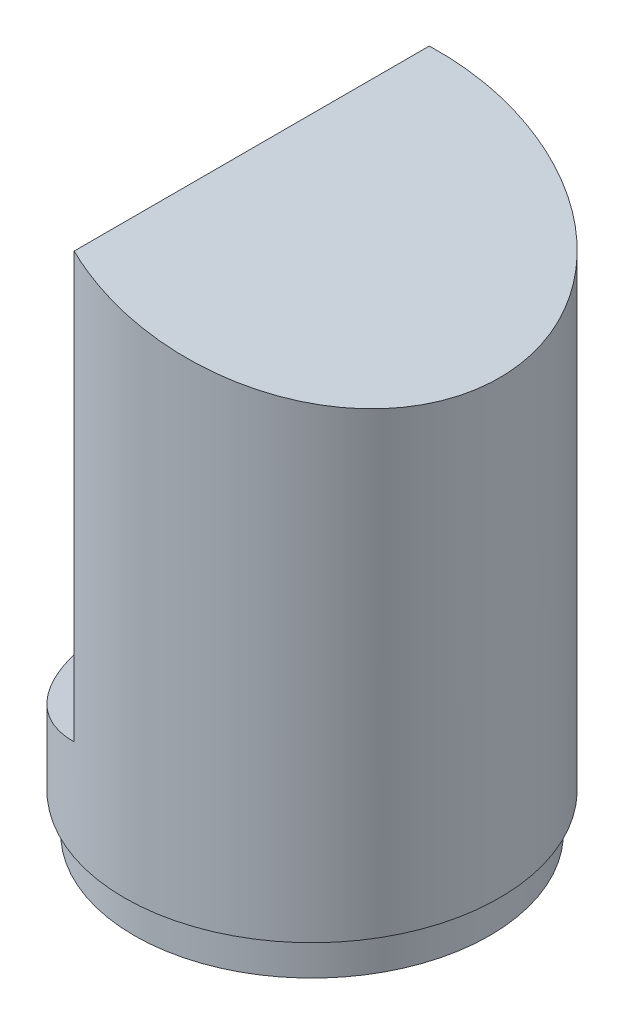
ISO-10303-21;
HEADER;
FILE_DESCRIPTION(('STEP AP214'),'2;1');
FILE_NAME('part.step','',(''),(''),'','','');
FILE_SCHEMA(('AUTOMOTIVE_DESIGN { 1 0 10303 214 1 1 1 1 }'));
ENDSEC;
DATA;
#1=APPLICATION_CONTEXT('core data for automotive mechanical design processes');
#2=APPLICATION_PROTOCOL_DEFINITION('international standard','automotive_design',2000,#1);
#3=PRODUCT_CONTEXT('',#1,'mechanical');
#4=PRODUCT('Part','Part','',(#3));
#5=PRODUCT_RELATED_PRODUCT_CATEGORY('part','',(#4));
#6=PRODUCT_DEFINITION_FORMATION('','',#4);
#7=PRODUCT_DEFINITION_CONTEXT('part definition',#1,'design');
#8=PRODUCT_DEFINITION('design','',#6,#7);
#9=PRODUCT_DEFINITION_SHAPE('','',#8);
#10=(LENGTH_UNIT() NAMED_UNIT(*) SI_UNIT(.MILLI.,.METRE.));
#11=(NAMED_UNIT(*) PLANE_ANGLE_UNIT() SI_UNIT($,.RADIAN.));
#12=(NAMED_UNIT(*) SI_UNIT($,.STERADIAN.) SOLID_ANGLE_UNIT());
#13=UNCERTAINTY_MEASURE_WITH_UNIT(LENGTH_MEASURE(1.E-05),#10,'distance_accuracy_value','');
#14=(GEOMETRIC_REPRESENTATION_CONTEXT(3) GLOBAL_UNCERTAINTY_ASSIGNED_CONTEXT((#13)) GLOBAL_UNIT_ASSIGNED_CONTEXT((#10,
#11,#12)) REPRESENTATION_CONTEXT('',''));
#15=CARTESIAN_POINT('',(0.,0.,0.));
#16=DIRECTION('',(0.,0.,1.));
#17=DIRECTION('',(1.,0.,0.));
#18=AXIS2_PLACEMENT_3D('',#15,#16,#17);
#19=CARTESIAN_POINT('',(0.,45.,0.));
#20=DIRECTION('',(0.,-1.,0.));
#21=DIRECTION('',(0.,0.,-1.));
#22=AXIS2_PLACEMENT_3D('',#19,#20,#21);
#23=CYLINDRICAL_SURFACE('',#22,15.);
#24=CARTESIAN_POINT('',(0.,3.,0.));
#25=DIRECTION('',(0.,-1.,0.));
#26=DIRECTION('',(0.,0.,-1.));
#27=AXIS2_PLACEMENT_3D('',#24,#25,#26);
#28=CIRCLE('',#27,15.);
#29=CARTESIAN_POINT('',(0.,3.,-15.));
#30=VERTEX_POINT('',#29);
#31=EDGE_CURVE('E149',#30,#30,#28,.T.);
#32=ORIENTED_EDGE('',*,*,#31,.F.);
#33=EDGE_LOOP('',(#32));
#34=FACE_BOUND('',#33,.T.);
#35=DIRECTION('',(0.,1.,0.));
#36=VECTOR('',#35,1.);
#37=CARTESIAN_POINT('',(-4.82199399753466,11.,-14.2038154693638));
#38=LINE('',#37,#36);
#39=CARTESIAN_POINT('',(-4.82199399753466,11.,-14.2038154693638));
#40=VERTEX_POINT('',#39);
#41=CARTESIAN_POINT('',(-4.82199399753466,45.,-14.2038154693639));
#42=VERTEX_POINT('',#41);
#43=EDGE_CURVE('E68',#40,#42,#38,.T.);
#44=ORIENTED_EDGE('',*,*,#43,.T.);
#45=CARTESIAN_POINT('',(0.,43.5465537176237,0.));
#46=DIRECTION('',(-0.288595118782341,-0.957451229784059,0.));
#47=DIRECTION('',(0.957451229784059,-0.288595118782341,0.));
#48=AXIS2_PLACEMENT_3D('',#45,#46,#47);
#49=ELLIPSE('',#48,15.6665943218675,15.);
#50=CARTESIAN_POINT('',(-4.82199399753466,45.,14.2038154693638));
#51=VERTEX_POINT('',#50);
#52=EDGE_CURVE('E126',#51,#42,#49,.F.);
#53=ORIENTED_EDGE('',*,*,#52,.F.);
#54=DIRECTION('',(0.,1.,0.));
#55=VECTOR('',#54,1.);
#56=CARTESIAN_POINT('',(-4.82199399753466,11.,14.2038154693638));
#57=LINE('',#56,#55);
#58=CARTESIAN_POINT('',(-4.82199399753466,11.,14.2038154693638));
#59=VERTEX_POINT('',#58);
#60=EDGE_CURVE('E13',#59,#51,#57,.T.);
#61=ORIENTED_EDGE('',*,*,#60,.F.);
#62=CARTESIAN_POINT('',(0.,12.7075495888941,0.));
#63=DIRECTION('',(-0.333805462248969,0.942641985789277,0.));
#64=DIRECTION('',(-0.942641985789277,-0.333805462248969,0.));
#65=AXIS2_PLACEMENT_3D('',#62,#63,#64);
#66=ELLIPSE('',#65,15.9127221427979,15.);
#67=EDGE_CURVE('E153',#59,#40,#66,.F.);
#68=ORIENTED_EDGE('',*,*,#67,.T.);
#69=EDGE_LOOP('',(#44,#53,#61,#68));
#70=FACE_BOUND('',#69,.T.);
#71=ADVANCED_FACE('F59',(#34,#70),#23,.T.);
#72=CARTESIAN_POINT('',(-4.82199399753466,11.,0.));
#73=DIRECTION('',(-1.,0.,0.));
#74=DIRECTION('',(0.,0.,1.));
#75=AXIS2_PLACEMENT_3D('',#72,#73,#74);
#76=PLANE('',#75);
#77=CARTESIAN_POINT('',(-4.82199399753466,25.8483756418222,0.));
#78=DIRECTION('',(-1.,0.,0.));
#79=DIRECTION('',(0.,0.,1.));
#80=AXIS2_PLACEMENT_3D('',#77,#78,#79);
#81=CIRCLE('',#80,4.5159298216396);
#82=CARTESIAN_POINT('',(-4.82199399753466,25.8483756418222,4.5159298216396));
#83=VERTEX_POINT('',#82);
#84=EDGE_CURVE('E356',#83,#83,#81,.T.);
#85=ORIENTED_EDGE('',*,*,#84,.F.);
#86=EDGE_LOOP('',(#85));
#87=FACE_BOUND('',#86,.T.);
#88=DIRECTION('',(0.,0.,1.));
#89=VECTOR('',#88,1.);
#90=CARTESIAN_POINT('',(-4.82199399753466,45.,0.));
#91=LINE('',#90,#89);
#92=EDGE_CURVE('E156',#42,#51,#91,.T.);
#93=ORIENTED_EDGE('',*,*,#92,.F.);
#94=ORIENTED_EDGE('',*,*,#43,.F.);
#95=DIRECTION('',(0.,0.,1.));
#96=VECTOR('',#95,1.);
#97=CARTESIAN_POINT('',(-4.82199399753466,11.,0.));
#98=LINE('',#97,#96);
#99=EDGE_CURVE('E75',#40,#59,#98,.T.);
#100=ORIENTED_EDGE('',*,*,#99,.T.);
#101=ORIENTED_EDGE('',*,*,#60,.T.);
#102=EDGE_LOOP('',(#93,#94,#100,#101));
#103=FACE_BOUND('',#102,.T.);
#104=ADVANCED_FACE('F174',(#87,#103),#76,.T.);
#105=CARTESIAN_POINT('',(-4.82199399753466,11.,-15.2569816537137));
#106=DIRECTION('',(-0.333805462248969,0.942641985789277,0.));
#107=DIRECTION('',(-0.942641985789277,-0.333805462248969,0.));
#108=AXIS2_PLACEMENT_3D('',#105,#106,#107);
#109=PLANE('',#108);
#110=ORIENTED_EDGE('',*,*,#67,.F.);
#111=ORIENTED_EDGE('',*,*,#99,.F.);
#112=EDGE_LOOP('',(#110,#111));
#113=FACE_BOUND('',#112,.T.);
#114=ADVANCED_FACE('F176',(#113),#109,.T.);
#115=CARTESIAN_POINT('',(0.,3.,0.));
#116=DIRECTION('',(0.,-1.,0.));
#117=DIRECTION('',(0.,0.,-1.));
#118=AXIS2_PLACEMENT_3D('',#115,#116,#117);
#119=PLANE('',#118);
#120=CARTESIAN_POINT('',(0.,3.,0.));
#121=DIRECTION('',(0.,-1.,0.));
#122=DIRECTION('',(0.,0.,-1.));
#123=AXIS2_PLACEMENT_3D('',#120,#121,#122);
#124=CIRCLE('',#123,14.2220153833762);
#125=CARTESIAN_POINT('',(0.,3.,-14.2220153833762));
#126=VERTEX_POINT('',#125);
#127=EDGE_CURVE('E145',#126,#126,#124,.T.);
#128=ORIENTED_EDGE('',*,*,#127,.F.);
#129=EDGE_LOOP('',(#128));
#130=FACE_BOUND('',#129,.T.);
#131=ORIENTED_EDGE('',*,*,#31,.T.);
#132=EDGE_LOOP('',(#131));
#133=FACE_BOUND('',#132,.T.);
#134=ADVANCED_FACE('F183',(#130,#133),#119,.T.);
#135=CARTESIAN_POINT('',(0.,3.,0.));
#136=DIRECTION('',(0.,-1.,0.));
#137=DIRECTION('',(0.,0.,-1.));
#138=AXIS2_PLACEMENT_3D('',#135,#136,#137);
#139=CYLINDRICAL_SURFACE('',#138,14.2220153833762);
#140=ORIENTED_EDGE('',*,*,#127,.T.);
#141=EDGE_LOOP('',(#140));
#142=FACE_BOUND('',#141,.T.);
#143=CARTESIAN_POINT('',(0.,0.,0.));
#144=DIRECTION('',(0.,-1.,0.));
#145=DIRECTION('',(0.,0.,-1.));
#146=AXIS2_PLACEMENT_3D('',#143,#144,#145);
#147=CIRCLE('',#146,14.2220153833762);
#148=CARTESIAN_POINT('',(0.,0.,-14.2220153833762));
#149=VERTEX_POINT('',#148);
#150=EDGE_CURVE('E144',#149,#149,#147,.T.);
#151=ORIENTED_EDGE('',*,*,#150,.F.);
#152=EDGE_LOOP('',(#151));
#153=FACE_BOUND('',#152,.T.);
#154=ADVANCED_FACE('F190',(#142,#153),#139,.T.);
#155=CARTESIAN_POINT('',(0.,0.,0.));
#156=DIRECTION('',(0.,1.,0.));
#157=DIRECTION('',(0.,0.,1.));
#158=AXIS2_PLACEMENT_3D('',#155,#156,#157);
#159=PLANE('',#158);
#160=CARTESIAN_POINT('',(0.,0.,0.));
#161=DIRECTION('',(0.,1.,0.));
#162=DIRECTION('',(0.,0.,1.));
#163=AXIS2_PLACEMENT_3D('',#160,#161,#162);
#164=CIRCLE('',#163,12.7220153833762);
#165=CARTESIAN_POINT('',(0.,0.,12.7220153833762));
#166=VERTEX_POINT('',#165);
#167=EDGE_CURVE('E111',#166,#166,#164,.F.);
#168=ORIENTED_EDGE('',*,*,#167,.F.);
#169=EDGE_LOOP('',(#168));
#170=FACE_BOUND('',#169,.T.);
#171=ORIENTED_EDGE('',*,*,#150,.T.);
#172=EDGE_LOOP('',(#171));
#173=FACE_BOUND('',#172,.T.);
#174=ADVANCED_FACE('F188',(#170,#173),#159,.F.);
#175=CARTESIAN_POINT('',(-4.82199399753466,45.,0.));
#176=DIRECTION('',(-0.288595118782341,-0.957451229784059,0.));
#177=DIRECTION('',(0.957451229784059,-0.288595118782341,0.));
#178=AXIS2_PLACEMENT_3D('',#175,#176,#177);
#179=PLANE('',#178);
#180=ORIENTED_EDGE('',*,*,#52,.T.);
#181=ORIENTED_EDGE('',*,*,#92,.T.);
#182=EDGE_LOOP('',(#180,#181));
#183=FACE_BOUND('',#182,.T.);
#184=ADVANCED_FACE('F170',(#183),#179,.F.);
#185=CARTESIAN_POINT('',(0.,45.,0.));
#186=DIRECTION('',(0.,-1.,0.));
#187=DIRECTION('',(0.,0.,-1.));
#188=AXIS2_PLACEMENT_3D('',#185,#186,#187);
#189=CYLINDRICAL_SURFACE('',#188,13.5);
#190=CARTESIAN_POINT('',(0.,4.5,0.));
#191=DIRECTION('',(0.,-1.,0.));
#192=DIRECTION('',(0.,0.,-1.));
#193=AXIS2_PLACEMENT_3D('',#190,#191,#192);
#194=CIRCLE('',#193,13.5);
#195=CARTESIAN_POINT('',(0.,4.5,-13.5));
#196=VERTEX_POINT('',#195);
#197=EDGE_CURVE('E130',#196,#196,#194,.T.);
#198=ORIENTED_EDGE('',*,*,#197,.T.);
#199=EDGE_LOOP('',(#198));
#200=FACE_BOUND('',#199,.T.);
#201=DIRECTION('',(0.,-1.,0.));
#202=VECTOR('',#201,1.);
#203=CARTESIAN_POINT('',(-3.32199399753466,9.93990314277181,-13.0848903656219));
#204=LINE('',#203,#202);
#205=CARTESIAN_POINT('',(-3.32199399753466,9.93990314277181,-13.0848903656219));
#206=VERTEX_POINT('',#205);
#207=CARTESIAN_POINT('',(-3.32199399753466,42.9812103028898,-13.0848903656219));
#208=VERTEX_POINT('',#207);
#209=EDGE_CURVE('E106',#206,#208,#204,.F.);
#210=ORIENTED_EDGE('',*,*,#209,.F.);
#211=CARTESIAN_POINT('',(0.,11.1162773746143,0.));
#212=DIRECTION('',(-0.333805462248969,0.942641985789277,0.));
#213=DIRECTION('',(-0.942641985789277,-0.333805462248969,0.));
#214=AXIS2_PLACEMENT_3D('',#211,#212,#213);
#215=ELLIPSE('',#214,14.3214499285181,13.5);
#216=CARTESIAN_POINT('',(-3.32199399753466,9.93990314277181,13.0848903656219));
#217=VERTEX_POINT('',#216);
#218=EDGE_CURVE('E118',#217,#206,#215,.F.);
#219=ORIENTED_EDGE('',*,*,#218,.F.);
#220=DIRECTION('',(0.,-1.,0.));
#221=VECTOR('',#220,1.);
#222=CARTESIAN_POINT('',(-3.32199399753466,9.93990314277181,13.0848903656219));
#223=LINE('',#222,#221);
#224=CARTESIAN_POINT('',(-3.32199399753466,42.9812103028898,13.0848903656219));
#225=VERTEX_POINT('',#224);
#226=EDGE_CURVE('E108',#217,#225,#223,.F.);
#227=ORIENTED_EDGE('',*,*,#226,.T.);
#228=CARTESIAN_POINT('',(0.,41.979894285437,0.));
#229=DIRECTION('',(-0.288595118782341,-0.957451229784059,0.));
#230=DIRECTION('',(0.957451229784059,-0.288595118782341,0.));
#231=AXIS2_PLACEMENT_3D('',#228,#229,#230);
#232=ELLIPSE('',#231,14.0999348896808,13.5);
#233=EDGE_CURVE('E101',#225,#208,#232,.F.);
#234=ORIENTED_EDGE('',*,*,#233,.T.);
#235=EDGE_LOOP('',(#210,#219,#227,#234));
#236=FACE_BOUND('',#235,.T.);
#237=ADVANCED_FACE('F103',(#200,#236),#189,.F.);
#238=CARTESIAN_POINT('',(-3.32199399753466,11.,0.));
#239=DIRECTION('',(-1.,0.,0.));
#240=DIRECTION('',(0.,0.,1.));
#241=AXIS2_PLACEMENT_3D('',#238,#239,#240);
#242=PLANE('',#241);
#243=CARTESIAN_POINT('',(-3.32199399753466,25.8483756418222,0.));
#244=DIRECTION('',(-1.,0.,0.));
#245=DIRECTION('',(0.,0.,1.));
#246=AXIS2_PLACEMENT_3D('',#243,#244,#245);
#247=CIRCLE('',#246,4.5159298216396);
#248=CARTESIAN_POINT('',(-3.32199399753466,25.8483756418222,4.5159298216396));
#249=VERTEX_POINT('',#248);
#250=EDGE_CURVE('E62',#249,#249,#247,.T.);
#251=ORIENTED_EDGE('',*,*,#250,.T.);
#252=EDGE_LOOP('',(#251));
#253=FACE_BOUND('',#252,.T.);
#254=DIRECTION('',(0.,0.,1.));
#255=VECTOR('',#254,1.);
#256=CARTESIAN_POINT('',(-3.32199399753466,42.9812103028898,0.));
#257=LINE('',#256,#255);
#258=EDGE_CURVE('E113',#208,#225,#257,.T.);
#259=ORIENTED_EDGE('',*,*,#258,.T.);
#260=ORIENTED_EDGE('',*,*,#226,.F.);
#261=DIRECTION('',(0.,0.,1.));
#262=VECTOR('',#261,1.);
#263=CARTESIAN_POINT('',(-3.32199399753466,9.93990314277181,-15.2569816537137));
#264=LINE('',#263,#262);
#265=EDGE_CURVE('E117',#206,#217,#264,.T.);
#266=ORIENTED_EDGE('',*,*,#265,.F.);
#267=ORIENTED_EDGE('',*,*,#209,.T.);
#268=EDGE_LOOP('',(#259,#260,#266,#267));
#269=FACE_BOUND('',#268,.T.);
#270=ADVANCED_FACE('F120',(#253,#269),#242,.F.);
#271=CARTESIAN_POINT('',(-4.3212858041612,9.58603702131607,-15.2569816537137));
#272=DIRECTION('',(-0.333805462248969,0.942641985789277,0.));
#273=DIRECTION('',(-0.942641985789277,-0.333805462248969,0.));
#274=AXIS2_PLACEMENT_3D('',#271,#272,#273);
#275=PLANE('',#274);
#276=ORIENTED_EDGE('',*,*,#218,.T.);
#277=ORIENTED_EDGE('',*,*,#265,.T.);
#278=EDGE_LOOP('',(#276,#277));
#279=FACE_BOUND('',#278,.T.);
#280=ADVANCED_FACE('F215',(#279),#275,.F.);
#281=CARTESIAN_POINT('',(0.,4.5,0.));
#282=DIRECTION('',(0.,-1.,0.));
#283=DIRECTION('',(0.,0.,-1.));
#284=AXIS2_PLACEMENT_3D('',#281,#282,#283);
#285=PLANE('',#284);
#286=CARTESIAN_POINT('',(0.,4.5,0.));
#287=DIRECTION('',(0.,-1.,0.));
#288=DIRECTION('',(0.,0.,-1.));
#289=AXIS2_PLACEMENT_3D('',#286,#287,#288);
#290=CIRCLE('',#289,12.7220153833762);
#291=CARTESIAN_POINT('',(0.,4.5,-12.7220153833762));
#292=VERTEX_POINT('',#291);
#293=EDGE_CURVE('E135',#292,#292,#290,.T.);
#294=ORIENTED_EDGE('',*,*,#293,.T.);
#295=EDGE_LOOP('',(#294));
#296=FACE_BOUND('',#295,.T.);
#297=ORIENTED_EDGE('',*,*,#197,.F.);
#298=EDGE_LOOP('',(#297));
#299=FACE_BOUND('',#298,.T.);
#300=ADVANCED_FACE('F206',(#296,#299),#285,.F.);
#301=CARTESIAN_POINT('',(0.,3.,0.));
#302=DIRECTION('',(0.,-1.,0.));
#303=DIRECTION('',(0.,0.,-1.));
#304=AXIS2_PLACEMENT_3D('',#301,#302,#303);
#305=CYLINDRICAL_SURFACE('',#304,12.7220153833762);
#306=ORIENTED_EDGE('',*,*,#293,.F.);
#307=EDGE_LOOP('',(#306));
#308=FACE_BOUND('',#307,.T.);
#309=ORIENTED_EDGE('',*,*,#167,.T.);
#310=EDGE_LOOP('',(#309));
#311=FACE_BOUND('',#310,.T.);
#312=ADVANCED_FACE('F204',(#308,#311),#305,.F.);
#313=CARTESIAN_POINT('',(-5.25488667570817,43.5638231553239,0.));
#314=DIRECTION('',(-0.288595118782341,-0.957451229784059,0.));
#315=DIRECTION('',(0.957451229784059,-0.288595118782341,0.));
#316=AXIS2_PLACEMENT_3D('',#313,#314,#315);
#317=PLANE('',#316);
#318=ORIENTED_EDGE('',*,*,#233,.F.);
#319=ORIENTED_EDGE('',*,*,#258,.F.);
#320=EDGE_LOOP('',(#318,#319));
#321=FACE_BOUND('',#320,.T.);
#322=ADVANCED_FACE('F114',(#321),#317,.T.);
#323=CARTESIAN_POINT('',(2.17800600246534,25.8483756418222,0.));
#324=DIRECTION('',(-1.,0.,0.));
#325=DIRECTION('',(0.,0.,1.));
#326=AXIS2_PLACEMENT_3D('',#323,#324,#325);
#327=CYLINDRICAL_SURFACE('',#326,4.5159298216396);
#328=ORIENTED_EDGE('',*,*,#84,.T.);
#329=EDGE_LOOP('',(#328));
#330=FACE_BOUND('',#329,.T.);
#331=ORIENTED_EDGE('',*,*,#250,.F.);
#332=EDGE_LOOP('',(#331));
#333=FACE_BOUND('',#332,.T.);
#334=ADVANCED_FACE('F213',(#330,#333),#327,.F.);
#335=CLOSED_SHELL('',(#71,#104,#114,#134,#154,#174,#184,#237,#270,#280,#300,#312,#322,#334));
#336=MANIFOLD_SOLID_BREP('B2',#335);
#337=ADVANCED_BREP_SHAPE_REPRESENTATION('',(#18,#336),#14);
#338=SHAPE_DEFINITION_REPRESENTATION(#9,#337);
ENDSEC;
END-ISO-10303-21;
